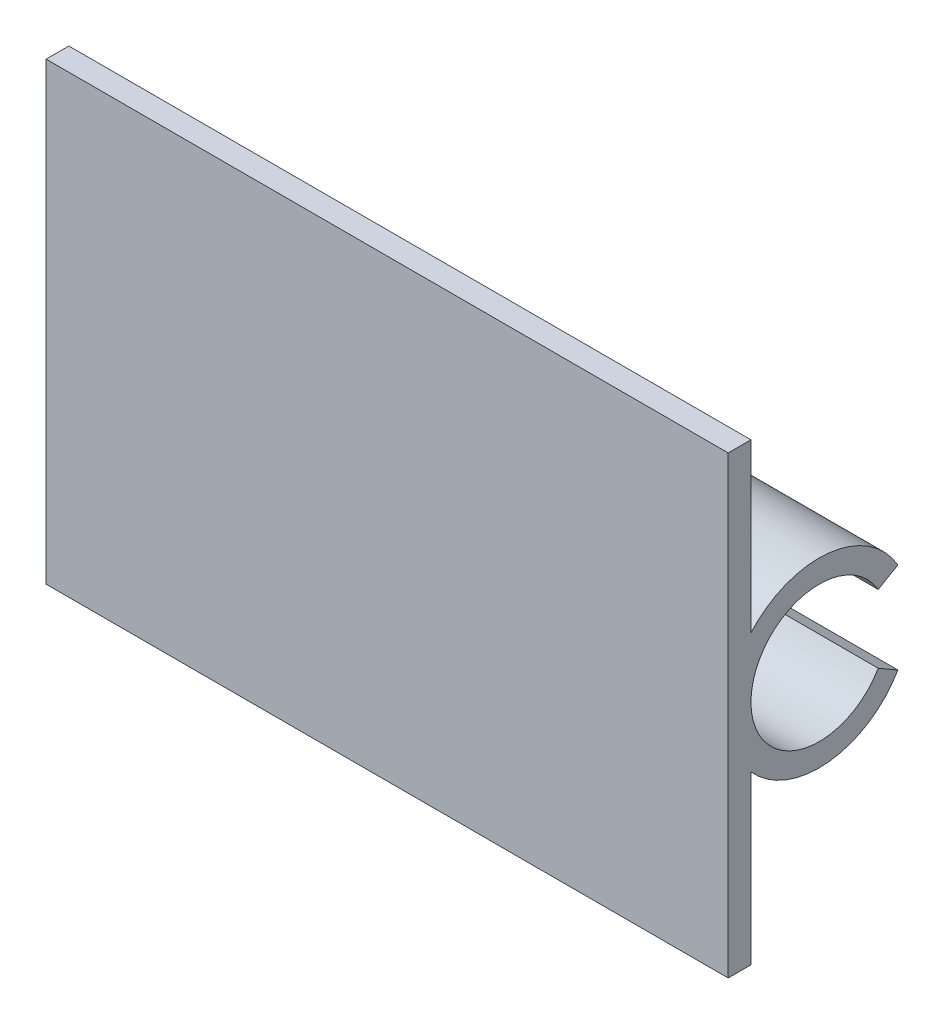
ISO-10303-21;
HEADER;
FILE_DESCRIPTION(('STEP AP214'),'2;1');
FILE_NAME('part.step','',(''),(''),'','','');
FILE_SCHEMA(('AUTOMOTIVE_DESIGN { 1 0 10303 214 1 1 1 1 }'));
ENDSEC;
DATA;
#1=APPLICATION_CONTEXT('core data for automotive mechanical design processes');
#2=APPLICATION_PROTOCOL_DEFINITION('international standard','automotive_design',2000,#1);
#3=PRODUCT_CONTEXT('',#1,'mechanical');
#4=PRODUCT('Part','Part','',(#3));
#5=PRODUCT_RELATED_PRODUCT_CATEGORY('part','',(#4));
#6=PRODUCT_DEFINITION_FORMATION('','',#4);
#7=PRODUCT_DEFINITION_CONTEXT('part definition',#1,'design');
#8=PRODUCT_DEFINITION('design','',#6,#7);
#9=PRODUCT_DEFINITION_SHAPE('','',#8);
#10=(LENGTH_UNIT() NAMED_UNIT(*) SI_UNIT(.MILLI.,.METRE.));
#11=(NAMED_UNIT(*) PLANE_ANGLE_UNIT() SI_UNIT($,.RADIAN.));
#12=(NAMED_UNIT(*) SI_UNIT($,.STERADIAN.) SOLID_ANGLE_UNIT());
#13=UNCERTAINTY_MEASURE_WITH_UNIT(LENGTH_MEASURE(1.E-05),#10,'distance_accuracy_value','');
#14=(GEOMETRIC_REPRESENTATION_CONTEXT(3) GLOBAL_UNCERTAINTY_ASSIGNED_CONTEXT((#13)) GLOBAL_UNIT_ASSIGNED_CONTEXT((#10,
#11,#12)) REPRESENTATION_CONTEXT('',''));
#15=CARTESIAN_POINT('',(0.,0.,0.));
#16=DIRECTION('',(0.,0.,1.));
#17=DIRECTION('',(1.,0.,0.));
#18=AXIS2_PLACEMENT_3D('',#15,#16,#17);
#19=CARTESIAN_POINT('',(0.,0.,1.2));
#20=DIRECTION('',(-1.,0.,0.));
#21=DIRECTION('',(0.,0.,1.));
#22=AXIS2_PLACEMENT_3D('',#19,#20,#21);
#23=PLANE('',#22);
#24=DIRECTION('',(0.,1.,0.));
#25=VECTOR('',#24,1.);
#26=CARTESIAN_POINT('',(0.,0.,0.));
#27=LINE('',#26,#25);
#28=CARTESIAN_POINT('',(0.,-12.,0.));
#29=VERTEX_POINT('',#28);
#30=CARTESIAN_POINT('',(0.,12.,0.));
#31=VERTEX_POINT('',#30);
#32=EDGE_CURVE('E176',#29,#31,#27,.T.);
#33=ORIENTED_EDGE('',*,*,#32,.F.);
#34=DIRECTION('',(0.,0.,-1.));
#35=VECTOR('',#34,1.);
#36=CARTESIAN_POINT('',(0.,-12.,1.2));
#37=LINE('',#36,#35);
#38=CARTESIAN_POINT('',(0.,-12.,1.2));
#39=VERTEX_POINT('',#38);
#40=EDGE_CURVE('E143',#39,#29,#37,.T.);
#41=ORIENTED_EDGE('',*,*,#40,.F.);
#42=DIRECTION('',(0.,1.,0.));
#43=VECTOR('',#42,1.);
#44=CARTESIAN_POINT('',(0.,0.,1.2));
#45=LINE('',#44,#43);
#46=CARTESIAN_POINT('',(0.,12.,1.2));
#47=VERTEX_POINT('',#46);
#48=EDGE_CURVE('E177',#39,#47,#45,.T.);
#49=ORIENTED_EDGE('',*,*,#48,.T.);
#50=DIRECTION('',(0.,0.,-1.));
#51=VECTOR('',#50,1.);
#52=CARTESIAN_POINT('',(0.,12.,1.2));
#53=LINE('',#52,#51);
#54=EDGE_CURVE('E186',#47,#31,#53,.T.);
#55=ORIENTED_EDGE('',*,*,#54,.T.);
#56=EDGE_LOOP('',(#33,#41,#49,#55));
#57=FACE_BOUND('',#56,.T.);
#58=ADVANCED_FACE('F33',(#57),#23,.T.);
#59=CARTESIAN_POINT('',(36.,12.,1.2));
#60=DIRECTION('',(1.,0.,0.));
#61=DIRECTION('',(0.,0.,-1.));
#62=AXIS2_PLACEMENT_3D('',#59,#60,#61);
#63=PLANE('',#62);
#64=DIRECTION('',(0.,-1.,0.));
#65=VECTOR('',#64,1.);
#66=CARTESIAN_POINT('',(36.,12.,1.2));
#67=LINE('',#66,#65);
#68=CARTESIAN_POINT('',(36.,12.,1.2));
#69=VERTEX_POINT('',#68);
#70=CARTESIAN_POINT('',(36.,-12.,1.2));
#71=VERTEX_POINT('',#70);
#72=EDGE_CURVE('E184',#69,#71,#67,.T.);
#73=ORIENTED_EDGE('',*,*,#72,.T.);
#74=DIRECTION('',(0.,0.,-1.));
#75=VECTOR('',#74,1.);
#76=CARTESIAN_POINT('',(36.,-12.,1.2));
#77=LINE('',#76,#75);
#78=CARTESIAN_POINT('',(36.,-12.,0.));
#79=VERTEX_POINT('',#78);
#80=EDGE_CURVE('E148',#71,#79,#77,.T.);
#81=ORIENTED_EDGE('',*,*,#80,.T.);
#82=DIRECTION('',(0.,1.,0.));
#83=VECTOR('',#82,1.);
#84=CARTESIAN_POINT('',(36.,-12.,0.));
#85=LINE('',#84,#83);
#86=CARTESIAN_POINT('',(36.,-3.17490157327751,0.));
#87=VERTEX_POINT('',#86);
#88=EDGE_CURVE('E144',#79,#87,#85,.T.);
#89=ORIENTED_EDGE('',*,*,#88,.T.);
#90=CARTESIAN_POINT('',(36.,0.,-3.6));
#91=DIRECTION('',(-1.,0.,0.));
#92=DIRECTION('',(0.,0.,-1.));
#93=AXIS2_PLACEMENT_3D('',#90,#91,#92);
#94=CIRCLE('',#93,4.8);
#95=CARTESIAN_POINT('',(36.,-2.39999999999998,-7.75692193816532));
#96=VERTEX_POINT('',#95);
#97=EDGE_CURVE('E136',#96,#87,#94,.T.);
#98=ORIENTED_EDGE('',*,*,#97,.F.);
#99=DIRECTION('',(0.,-0.499999999999995,-0.866025403784441));
#100=VECTOR('',#99,1.);
#101=CARTESIAN_POINT('',(36.,-0.921539030917302,-5.19615242270658));
#102=LINE('',#101,#100);
#103=CARTESIAN_POINT('',(36.,-1.79999999999998,-6.71769145362399));
#104=VERTEX_POINT('',#103);
#105=EDGE_CURVE('E124',#104,#96,#102,.T.);
#106=ORIENTED_EDGE('',*,*,#105,.F.);
#107=CARTESIAN_POINT('',(36.,0.,-3.6));
#108=DIRECTION('',(1.,0.,0.));
#109=DIRECTION('',(0.,0.,-1.));
#110=AXIS2_PLACEMENT_3D('',#107,#108,#109);
#111=CIRCLE('',#110,3.6);
#112=CARTESIAN_POINT('',(36.,1.79999999999998,-6.71769145362399));
#113=VERTEX_POINT('',#112);
#114=EDGE_CURVE('E156',#113,#104,#111,.T.);
#115=ORIENTED_EDGE('',*,*,#114,.F.);
#116=DIRECTION('',(0.,0.499999999999995,-0.866025403784441));
#117=VECTOR('',#116,1.);
#118=CARTESIAN_POINT('',(36.,0.921539030917302,-5.19615242270658));
#119=LINE('',#118,#117);
#120=CARTESIAN_POINT('',(36.,2.39999999999998,-7.75692193816532));
#121=VERTEX_POINT('',#120);
#122=EDGE_CURVE('E160',#113,#121,#119,.T.);
#123=ORIENTED_EDGE('',*,*,#122,.T.);
#124=CARTESIAN_POINT('',(36.,0.,-3.6));
#125=DIRECTION('',(1.,0.,0.));
#126=DIRECTION('',(0.,0.,-1.));
#127=AXIS2_PLACEMENT_3D('',#124,#125,#126);
#128=CIRCLE('',#127,4.8);
#129=CARTESIAN_POINT('',(36.,3.17490157327751,0.));
#130=VERTEX_POINT('',#129);
#131=EDGE_CURVE('E168',#121,#130,#128,.T.);
#132=ORIENTED_EDGE('',*,*,#131,.T.);
#133=DIRECTION('',(0.,-1.,0.));
#134=VECTOR('',#133,1.);
#135=CARTESIAN_POINT('',(36.,12.,0.));
#136=LINE('',#135,#134);
#137=CARTESIAN_POINT('',(36.,12.,0.));
#138=VERTEX_POINT('',#137);
#139=EDGE_CURVE('E181',#138,#130,#136,.T.);
#140=ORIENTED_EDGE('',*,*,#139,.F.);
#141=DIRECTION('',(0.,0.,-1.));
#142=VECTOR('',#141,1.);
#143=CARTESIAN_POINT('',(36.,12.,1.2));
#144=LINE('',#143,#142);
#145=EDGE_CURVE('E193',#69,#138,#144,.T.);
#146=ORIENTED_EDGE('',*,*,#145,.F.);
#147=EDGE_LOOP('',(#73,#81,#89,#98,#106,#115,#123,#132,#140,#146));
#148=FACE_BOUND('',#147,.T.);
#149=ADVANCED_FACE('F213',(#148),#63,.T.);
#150=CARTESIAN_POINT('',(0.,12.,1.2));
#151=DIRECTION('',(0.,1.,0.));
#152=DIRECTION('',(0.,0.,1.));
#153=AXIS2_PLACEMENT_3D('',#150,#151,#152);
#154=PLANE('',#153);
#155=DIRECTION('',(1.,0.,0.));
#156=VECTOR('',#155,1.);
#157=CARTESIAN_POINT('',(0.,12.,0.));
#158=LINE('',#157,#156);
#159=EDGE_CURVE('E189',#31,#138,#158,.T.);
#160=ORIENTED_EDGE('',*,*,#159,.F.);
#161=ORIENTED_EDGE('',*,*,#54,.F.);
#162=DIRECTION('',(1.,0.,0.));
#163=VECTOR('',#162,1.);
#164=CARTESIAN_POINT('',(0.,12.,1.2));
#165=LINE('',#164,#163);
#166=EDGE_CURVE('E180',#47,#69,#165,.T.);
#167=ORIENTED_EDGE('',*,*,#166,.T.);
#168=ORIENTED_EDGE('',*,*,#145,.T.);
#169=EDGE_LOOP('',(#160,#161,#167,#168));
#170=FACE_BOUND('',#169,.T.);
#171=ADVANCED_FACE('F201',(#170),#154,.T.);
#172=CARTESIAN_POINT('',(0.,0.,1.2));
#173=DIRECTION('',(0.,0.,-1.));
#174=DIRECTION('',(-1.,0.,0.));
#175=AXIS2_PLACEMENT_3D('',#172,#173,#174);
#176=PLANE('',#175);
#177=ORIENTED_EDGE('',*,*,#48,.F.);
#178=DIRECTION('',(1.,0.,0.));
#179=VECTOR('',#178,1.);
#180=CARTESIAN_POINT('',(0.,-12.,1.2));
#181=LINE('',#180,#179);
#182=EDGE_CURVE('E140',#39,#71,#181,.T.);
#183=ORIENTED_EDGE('',*,*,#182,.T.);
#184=ORIENTED_EDGE('',*,*,#72,.F.);
#185=ORIENTED_EDGE('',*,*,#166,.F.);
#186=EDGE_LOOP('',(#177,#183,#184,#185));
#187=FACE_BOUND('',#186,.T.);
#188=ADVANCED_FACE('F211',(#187),#176,.F.);
#189=CARTESIAN_POINT('',(0.,0.,0.));
#190=DIRECTION('',(0.,0.,-1.));
#191=DIRECTION('',(-1.,0.,0.));
#192=AXIS2_PLACEMENT_3D('',#189,#190,#191);
#193=PLANE('',#192);
#194=DIRECTION('',(1.,0.,0.));
#195=VECTOR('',#194,1.);
#196=CARTESIAN_POINT('',(26.,3.17490157327751,0.));
#197=LINE('',#196,#195);
#198=CARTESIAN_POINT('',(26.,3.17490157327751,0.));
#199=VERTEX_POINT('',#198);
#200=EDGE_CURVE('E11',#199,#130,#197,.T.);
#201=ORIENTED_EDGE('',*,*,#200,.F.);
#202=DIRECTION('',(0.,-1.,0.));
#203=VECTOR('',#202,1.);
#204=CARTESIAN_POINT('',(26.,0.,0.));
#205=LINE('',#204,#203);
#206=CARTESIAN_POINT('',(26.,0.,0.));
#207=VERTEX_POINT('',#206);
#208=EDGE_CURVE('E40',#199,#207,#205,.T.);
#209=ORIENTED_EDGE('',*,*,#208,.T.);
#210=DIRECTION('',(0.,1.,0.));
#211=VECTOR('',#210,1.);
#212=CARTESIAN_POINT('',(26.,0.,0.));
#213=LINE('',#212,#211);
#214=CARTESIAN_POINT('',(26.,-3.17490157327751,0.));
#215=VERTEX_POINT('',#214);
#216=EDGE_CURVE('E151',#215,#207,#213,.T.);
#217=ORIENTED_EDGE('',*,*,#216,.F.);
#218=DIRECTION('',(1.,0.,0.));
#219=VECTOR('',#218,1.);
#220=CARTESIAN_POINT('',(26.,-3.17490157327751,0.));
#221=LINE('',#220,#219);
#222=EDGE_CURVE('E132',#215,#87,#221,.T.);
#223=ORIENTED_EDGE('',*,*,#222,.T.);
#224=ORIENTED_EDGE('',*,*,#88,.F.);
#225=DIRECTION('',(1.,0.,0.));
#226=VECTOR('',#225,1.);
#227=CARTESIAN_POINT('',(0.,-12.,0.));
#228=LINE('',#227,#226);
#229=EDGE_CURVE('E128',#29,#79,#228,.T.);
#230=ORIENTED_EDGE('',*,*,#229,.F.);
#231=ORIENTED_EDGE('',*,*,#32,.T.);
#232=ORIENTED_EDGE('',*,*,#159,.T.);
#233=ORIENTED_EDGE('',*,*,#139,.T.);
#234=EDGE_LOOP('',(#201,#209,#217,#223,#224,#230,#231,#232,#233));
#235=FACE_BOUND('',#234,.T.);
#236=ADVANCED_FACE('F203',(#235),#193,.T.);
#237=CARTESIAN_POINT('',(26.,0.,-3.6));
#238=DIRECTION('',(1.,0.,0.));
#239=DIRECTION('',(0.,0.,-1.));
#240=AXIS2_PLACEMENT_3D('',#237,#238,#239);
#241=CYLINDRICAL_SURFACE('',#240,3.6);
#242=ORIENTED_EDGE('',*,*,#114,.T.);
#243=DIRECTION('',(1.,0.,0.));
#244=VECTOR('',#243,1.);
#245=CARTESIAN_POINT('',(26.,-1.79999999999998,-6.71769145362399));
#246=LINE('',#245,#244);
#247=CARTESIAN_POINT('',(26.,-1.79999999999998,-6.71769145362399));
#248=VERTEX_POINT('',#247);
#249=EDGE_CURVE('E118',#248,#104,#246,.T.);
#250=ORIENTED_EDGE('',*,*,#249,.F.);
#251=CARTESIAN_POINT('',(26.,0.,-3.6));
#252=DIRECTION('',(-1.,0.,0.));
#253=DIRECTION('',(0.,0.,-1.));
#254=AXIS2_PLACEMENT_3D('',#251,#252,#253);
#255=CIRCLE('',#254,3.6);
#256=EDGE_CURVE('E114',#248,#207,#255,.T.);
#257=ORIENTED_EDGE('',*,*,#256,.T.);
#258=CARTESIAN_POINT('',(26.,0.,-3.6));
#259=DIRECTION('',(1.,0.,0.));
#260=DIRECTION('',(0.,0.,-1.));
#261=AXIS2_PLACEMENT_3D('',#258,#259,#260);
#262=CIRCLE('',#261,3.6);
#263=CARTESIAN_POINT('',(26.,1.79999999999998,-6.71769145362399));
#264=VERTEX_POINT('',#263);
#265=EDGE_CURVE('E157',#264,#207,#262,.T.);
#266=ORIENTED_EDGE('',*,*,#265,.F.);
#267=DIRECTION('',(1.,0.,0.));
#268=VECTOR('',#267,1.);
#269=CARTESIAN_POINT('',(26.,1.79999999999998,-6.71769145362399));
#270=LINE('',#269,#268);
#271=EDGE_CURVE('E166',#264,#113,#270,.T.);
#272=ORIENTED_EDGE('',*,*,#271,.T.);
#273=EDGE_LOOP('',(#242,#250,#257,#266,#272));
#274=FACE_BOUND('',#273,.T.);
#275=ADVANCED_FACE('F227',(#274),#241,.F.);
#276=CARTESIAN_POINT('',(26.,0.,-3.6));
#277=DIRECTION('',(1.,0.,0.));
#278=DIRECTION('',(0.,0.,-1.));
#279=AXIS2_PLACEMENT_3D('',#276,#277,#278);
#280=CYLINDRICAL_SURFACE('',#279,4.8);
#281=CARTESIAN_POINT('',(26.,0.,-3.6));
#282=DIRECTION('',(1.,0.,0.));
#283=DIRECTION('',(0.,0.,-1.));
#284=AXIS2_PLACEMENT_3D('',#281,#282,#283);
#285=CIRCLE('',#284,4.8);
#286=CARTESIAN_POINT('',(26.,2.39999999999998,-7.75692193816532));
#287=VERTEX_POINT('',#286);
#288=EDGE_CURVE('E159',#287,#199,#285,.T.);
#289=ORIENTED_EDGE('',*,*,#288,.T.);
#290=ORIENTED_EDGE('',*,*,#200,.T.);
#291=ORIENTED_EDGE('',*,*,#131,.F.);
#292=DIRECTION('',(1.,0.,0.));
#293=VECTOR('',#292,1.);
#294=CARTESIAN_POINT('',(26.,2.39999999999998,-7.75692193816532));
#295=LINE('',#294,#293);
#296=EDGE_CURVE('E174',#287,#121,#295,.T.);
#297=ORIENTED_EDGE('',*,*,#296,.F.);
#298=EDGE_LOOP('',(#289,#290,#291,#297));
#299=FACE_BOUND('',#298,.T.);
#300=ADVANCED_FACE('F216',(#299),#280,.T.);
#301=CARTESIAN_POINT('',(26.,0.921539030917302,-5.19615242270658));
#302=DIRECTION('',(0.,-0.866025403784441,-0.499999999999995));
#303=DIRECTION('',(0.,0.499999999999995,-0.866025403784441));
#304=AXIS2_PLACEMENT_3D('',#301,#302,#303);
#305=PLANE('',#304);
#306=ORIENTED_EDGE('',*,*,#122,.F.);
#307=ORIENTED_EDGE('',*,*,#271,.F.);
#308=DIRECTION('',(0.,0.499999999999995,-0.866025403784441));
#309=VECTOR('',#308,1.);
#310=CARTESIAN_POINT('',(26.,0.921539030917302,-5.19615242270658));
#311=LINE('',#310,#309);
#312=EDGE_CURVE('E163',#264,#287,#311,.T.);
#313=ORIENTED_EDGE('',*,*,#312,.T.);
#314=ORIENTED_EDGE('',*,*,#296,.T.);
#315=EDGE_LOOP('',(#306,#307,#313,#314));
#316=FACE_BOUND('',#315,.T.);
#317=ADVANCED_FACE('F223',(#316),#305,.T.);
#318=CARTESIAN_POINT('',(26.,0.,-3.6));
#319=DIRECTION('',(1.,0.,0.));
#320=DIRECTION('',(0.,0.,-1.));
#321=AXIS2_PLACEMENT_3D('',#318,#319,#320);
#322=PLANE('',#321);
#323=ORIENTED_EDGE('',*,*,#208,.F.);
#324=ORIENTED_EDGE('',*,*,#288,.F.);
#325=ORIENTED_EDGE('',*,*,#312,.F.);
#326=ORIENTED_EDGE('',*,*,#265,.T.);
#327=EDGE_LOOP('',(#323,#324,#325,#326));
#328=FACE_BOUND('',#327,.T.);
#329=ADVANCED_FACE('F220',(#328),#322,.F.);
#330=CARTESIAN_POINT('',(0.,-12.,1.2));
#331=DIRECTION('',(0.,-1.,0.));
#332=DIRECTION('',(0.,0.,1.));
#333=AXIS2_PLACEMENT_3D('',#330,#331,#332);
#334=PLANE('',#333);
#335=ORIENTED_EDGE('',*,*,#229,.T.);
#336=ORIENTED_EDGE('',*,*,#80,.F.);
#337=ORIENTED_EDGE('',*,*,#182,.F.);
#338=ORIENTED_EDGE('',*,*,#40,.T.);
#339=EDGE_LOOP('',(#335,#336,#337,#338));
#340=FACE_BOUND('',#339,.T.);
#341=ADVANCED_FACE('F208',(#340),#334,.T.);
#342=CARTESIAN_POINT('',(26.,0.,-3.6));
#343=DIRECTION('',(1.,0.,0.));
#344=DIRECTION('',(0.,0.,-1.));
#345=AXIS2_PLACEMENT_3D('',#342,#343,#344);
#346=CYLINDRICAL_SURFACE('',#345,4.8);
#347=CARTESIAN_POINT('',(26.,0.,-3.6));
#348=DIRECTION('',(-1.,0.,0.));
#349=DIRECTION('',(0.,0.,-1.));
#350=AXIS2_PLACEMENT_3D('',#347,#348,#349);
#351=CIRCLE('',#350,4.8);
#352=CARTESIAN_POINT('',(26.,-2.39999999999998,-7.75692193816532));
#353=VERTEX_POINT('',#352);
#354=EDGE_CURVE('E112',#353,#215,#351,.T.);
#355=ORIENTED_EDGE('',*,*,#354,.F.);
#356=DIRECTION('',(1.,0.,0.));
#357=VECTOR('',#356,1.);
#358=CARTESIAN_POINT('',(26.,-2.39999999999998,-7.75692193816532));
#359=LINE('',#358,#357);
#360=EDGE_CURVE('E121',#353,#96,#359,.T.);
#361=ORIENTED_EDGE('',*,*,#360,.T.);
#362=ORIENTED_EDGE('',*,*,#97,.T.);
#363=ORIENTED_EDGE('',*,*,#222,.F.);
#364=EDGE_LOOP('',(#355,#361,#362,#363));
#365=FACE_BOUND('',#364,.T.);
#366=ADVANCED_FACE('F131',(#365),#346,.T.);
#367=CARTESIAN_POINT('',(26.,-0.921539030917302,-5.19615242270658));
#368=DIRECTION('',(0.,0.866025403784441,-0.499999999999995));
#369=DIRECTION('',(0.,-0.499999999999995,-0.866025403784441));
#370=AXIS2_PLACEMENT_3D('',#367,#368,#369);
#371=PLANE('',#370);
#372=ORIENTED_EDGE('',*,*,#105,.T.);
#373=ORIENTED_EDGE('',*,*,#360,.F.);
#374=DIRECTION('',(0.,-0.499999999999995,-0.866025403784441));
#375=VECTOR('',#374,1.);
#376=CARTESIAN_POINT('',(26.,-0.921539030917302,-5.19615242270658));
#377=LINE('',#376,#375);
#378=EDGE_CURVE('E107',#248,#353,#377,.T.);
#379=ORIENTED_EDGE('',*,*,#378,.F.);
#380=ORIENTED_EDGE('',*,*,#249,.T.);
#381=EDGE_LOOP('',(#372,#373,#379,#380));
#382=FACE_BOUND('',#381,.T.);
#383=ADVANCED_FACE('F122',(#382),#371,.T.);
#384=CARTESIAN_POINT('',(26.,0.,-3.6));
#385=DIRECTION('',(1.,0.,0.));
#386=DIRECTION('',(0.,0.,-1.));
#387=AXIS2_PLACEMENT_3D('',#384,#385,#386);
#388=PLANE('',#387);
#389=ORIENTED_EDGE('',*,*,#216,.T.);
#390=ORIENTED_EDGE('',*,*,#256,.F.);
#391=ORIENTED_EDGE('',*,*,#378,.T.);
#392=ORIENTED_EDGE('',*,*,#354,.T.);
#393=EDGE_LOOP('',(#389,#390,#391,#392));
#394=FACE_BOUND('',#393,.T.);
#395=ADVANCED_FACE('F110',(#394),#388,.F.);
#396=CLOSED_SHELL('',(#58,#149,#171,#188,#236,#275,#300,#317,#329,#341,#366,#383,#395));
#397=MANIFOLD_SOLID_BREP('B2',#396);
#398=ADVANCED_BREP_SHAPE_REPRESENTATION('',(#18,#397),#14);
#399=SHAPE_DEFINITION_REPRESENTATION(#9,#398);
ENDSEC;
END-ISO-10303-21;
